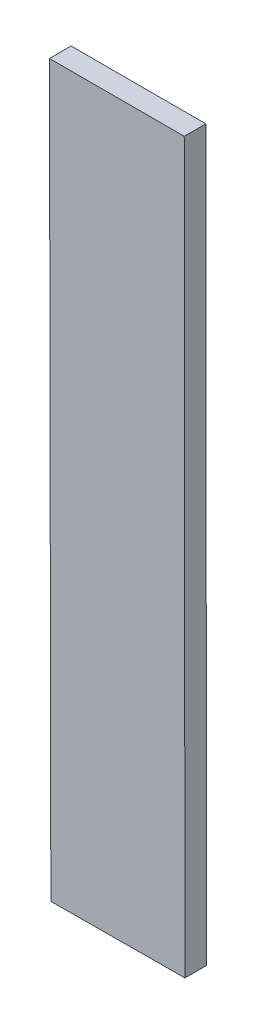
ISO-10303-21;
HEADER;
FILE_DESCRIPTION(('STEP AP214'),'2;1');
FILE_NAME('part.step','',(''),(''),'','','');
FILE_SCHEMA(('AUTOMOTIVE_DESIGN { 1 0 10303 214 1 1 1 1 }'));
ENDSEC;
DATA;
#1=APPLICATION_CONTEXT('core data for automotive mechanical design processes');
#2=APPLICATION_PROTOCOL_DEFINITION('international standard','automotive_design',2000,#1);
#3=PRODUCT_CONTEXT('',#1,'mechanical');
#4=PRODUCT('Part','Part','',(#3));
#5=PRODUCT_RELATED_PRODUCT_CATEGORY('part','',(#4));
#6=PRODUCT_DEFINITION_FORMATION('','',#4);
#7=PRODUCT_DEFINITION_CONTEXT('part definition',#1,'design');
#8=PRODUCT_DEFINITION('design','',#6,#7);
#9=PRODUCT_DEFINITION_SHAPE('','',#8);
#10=(LENGTH_UNIT() NAMED_UNIT(*) SI_UNIT(.MILLI.,.METRE.));
#11=(NAMED_UNIT(*) PLANE_ANGLE_UNIT() SI_UNIT($,.RADIAN.));
#12=(NAMED_UNIT(*) SI_UNIT($,.STERADIAN.) SOLID_ANGLE_UNIT());
#13=UNCERTAINTY_MEASURE_WITH_UNIT(LENGTH_MEASURE(1.E-05),#10,'distance_accuracy_value','');
#14=(GEOMETRIC_REPRESENTATION_CONTEXT(3) GLOBAL_UNCERTAINTY_ASSIGNED_CONTEXT((#13)) GLOBAL_UNIT_ASSIGNED_CONTEXT((#10,
#11,#12)) REPRESENTATION_CONTEXT('',''));
#15=CARTESIAN_POINT('',(0.,0.,0.));
#16=DIRECTION('',(0.,0.,1.));
#17=DIRECTION('',(1.,0.,0.));
#18=AXIS2_PLACEMENT_3D('',#15,#16,#17);
#19=CARTESIAN_POINT('',(0.,-48.5472175390625,0.001));
#20=DIRECTION('',(0.,-1.,0.));
#21=DIRECTION('',(0.,0.,-1.));
#22=AXIS2_PLACEMENT_3D('',#19,#20,#21);
#23=PLANE('',#22);
#24=DIRECTION('',(-1.,0.,0.));
#25=VECTOR('',#24,1.);
#26=CARTESIAN_POINT('',(0.,-48.5472175390625,0.));
#27=LINE('',#26,#25);
#28=CARTESIAN_POINT('',(-1.853980546875,-48.5472175390625,0.));
#29=VERTEX_POINT('',#28);
#30=CARTESIAN_POINT('',(-1.8602190234375,-48.5472175390625,0.));
#31=VERTEX_POINT('',#30);
#32=EDGE_CURVE('E11',#29,#31,#27,.T.);
#33=ORIENTED_EDGE('',*,*,#32,.T.);
#34=DIRECTION('',(0.,0.,-1.));
#35=VECTOR('',#34,1.);
#36=CARTESIAN_POINT('',(-1.8602190234375,-48.5472175390625,0.001));
#37=LINE('',#36,#35);
#38=CARTESIAN_POINT('',(-1.8602190234375,-48.5472175390625,0.001));
#39=VERTEX_POINT('',#38);
#40=EDGE_CURVE('E24',#39,#31,#37,.T.);
#41=ORIENTED_EDGE('',*,*,#40,.F.);
#42=DIRECTION('',(-1.,0.,0.));
#43=VECTOR('',#42,1.);
#44=CARTESIAN_POINT('',(0.,-48.5472175390625,0.001));
#45=LINE('',#44,#43);
#46=CARTESIAN_POINT('',(-1.853980546875,-48.5472175390625,0.001));
#47=VERTEX_POINT('',#46);
#48=EDGE_CURVE('E88',#47,#39,#45,.T.);
#49=ORIENTED_EDGE('',*,*,#48,.F.);
#50=DIRECTION('',(0.,0.,-1.));
#51=VECTOR('',#50,1.);
#52=CARTESIAN_POINT('',(-1.853980546875,-48.5472175390625,0.001));
#53=LINE('',#52,#51);
#54=EDGE_CURVE('E77',#47,#29,#53,.T.);
#55=ORIENTED_EDGE('',*,*,#54,.T.);
#56=EDGE_LOOP('',(#33,#41,#49,#55));
#57=FACE_BOUND('',#56,.T.);
#58=ADVANCED_FACE('F17',(#57),#23,.F.);
#59=CARTESIAN_POINT('',(-1.9522446473268,-0.00370093772007133,0.001));
#60=DIRECTION('',(0.999998203100012,0.0018957311907214,0.));
#61=DIRECTION('',(-0.0018957311907214,0.999998203100012,0.));
#62=AXIS2_PLACEMENT_3D('',#59,#60,#61);
#63=PLANE('',#62);
#64=DIRECTION('',(0.0018957311907214,-0.999998203100012,0.));
#65=VECTOR('',#64,1.);
#66=CARTESIAN_POINT('',(-1.9522446473268,-0.00370093772007133,0.));
#67=LINE('',#66,#65);
#68=CARTESIAN_POINT('',(-1.8601550390625,-48.580969296875,0.));
#69=VERTEX_POINT('',#68);
#70=EDGE_CURVE('E85',#31,#69,#67,.T.);
#71=ORIENTED_EDGE('',*,*,#70,.T.);
#72=DIRECTION('',(0.,0.,-1.));
#73=VECTOR('',#72,1.);
#74=CARTESIAN_POINT('',(-1.8601550390625,-48.580969296875,0.001));
#75=LINE('',#74,#73);
#76=CARTESIAN_POINT('',(-1.8601550390625,-48.580969296875,0.001));
#77=VERTEX_POINT('',#76);
#78=EDGE_CURVE('E83',#77,#69,#75,.T.);
#79=ORIENTED_EDGE('',*,*,#78,.F.);
#80=DIRECTION('',(0.0018957311907214,-0.999998203100012,0.));
#81=VECTOR('',#80,1.);
#82=CARTESIAN_POINT('',(-1.9522446473268,-0.00370093772007133,0.001));
#83=LINE('',#82,#81);
#84=EDGE_CURVE('E72',#39,#77,#83,.T.);
#85=ORIENTED_EDGE('',*,*,#84,.F.);
#86=ORIENTED_EDGE('',*,*,#40,.T.);
#87=EDGE_LOOP('',(#71,#79,#85,#86));
#88=FACE_BOUND('',#87,.T.);
#89=ADVANCED_FACE('F90',(#88),#63,.F.);
#90=CARTESIAN_POINT('',(0.250361290418771,-48.5700903467243,0.001));
#91=DIRECTION('',(-0.0051545706958729,0.999986715112227,0.));
#92=DIRECTION('',(-0.999986715112227,-0.0051545706958729,0.));
#93=AXIS2_PLACEMENT_3D('',#90,#91,#92);
#94=PLANE('',#93);
#95=DIRECTION('',(0.999986715112227,0.0051545706958729,0.));
#96=VECTOR('',#95,1.);
#97=CARTESIAN_POINT('',(0.250361290418771,-48.5700903467243,0.));
#98=LINE('',#97,#96);
#99=CARTESIAN_POINT('',(-1.8539485546875,-48.5809373046875,0.));
#100=VERTEX_POINT('',#99);
#101=EDGE_CURVE('E60',#69,#100,#98,.T.);
#102=ORIENTED_EDGE('',*,*,#101,.T.);
#103=DIRECTION('',(0.,0.,-1.));
#104=VECTOR('',#103,1.);
#105=CARTESIAN_POINT('',(-1.8539485546875,-48.5809373046875,0.001));
#106=LINE('',#105,#104);
#107=CARTESIAN_POINT('',(-1.8539485546875,-48.5809373046875,0.001));
#108=VERTEX_POINT('',#107);
#109=EDGE_CURVE('E54',#108,#100,#106,.T.);
#110=ORIENTED_EDGE('',*,*,#109,.F.);
#111=DIRECTION('',(0.999986715112227,0.0051545706958729,0.));
#112=VECTOR('',#111,1.);
#113=CARTESIAN_POINT('',(0.250361290418771,-48.5700903467243,0.001));
#114=LINE('',#113,#112);
#115=EDGE_CURVE('E58',#77,#108,#114,.T.);
#116=ORIENTED_EDGE('',*,*,#115,.F.);
#117=ORIENTED_EDGE('',*,*,#78,.T.);
#118=EDGE_LOOP('',(#102,#110,#116,#117));
#119=FACE_BOUND('',#118,.T.);
#120=ADVANCED_FACE('F56',(#119),#94,.F.);
#121=CARTESIAN_POINT('',(-1.9000388152293,-0.00180269337307432,0.001));
#122=DIRECTION('',(-0.99999954992127,-0.000948766176391401,0.));
#123=DIRECTION('',(0.000948766176391401,-0.99999954992127,0.));
#124=AXIS2_PLACEMENT_3D('',#121,#122,#123);
#125=PLANE('',#124);
#126=DIRECTION('',(-0.000948766176391401,0.99999954992127,0.));
#127=VECTOR('',#126,1.);
#128=CARTESIAN_POINT('',(-1.9000388152293,-0.00180269337307432,0.));
#129=LINE('',#128,#127);
#130=EDGE_CURVE('E73',#100,#29,#129,.T.);
#131=ORIENTED_EDGE('',*,*,#130,.T.);
#132=ORIENTED_EDGE('',*,*,#54,.F.);
#133=DIRECTION('',(-0.000948766176391401,0.99999954992127,0.));
#134=VECTOR('',#133,1.);
#135=CARTESIAN_POINT('',(-1.9000388152293,-0.00180269337307432,0.001));
#136=LINE('',#135,#134);
#137=EDGE_CURVE('E70',#108,#47,#136,.T.);
#138=ORIENTED_EDGE('',*,*,#137,.F.);
#139=ORIENTED_EDGE('',*,*,#109,.T.);
#140=EDGE_LOOP('',(#131,#132,#138,#139));
#141=FACE_BOUND('',#140,.T.);
#142=ADVANCED_FACE('F76',(#141),#125,.F.);
#143=CARTESIAN_POINT('',(0.,0.,0.001));
#144=DIRECTION('',(0.,0.,1.));
#145=DIRECTION('',(1.,0.,0.));
#146=AXIS2_PLACEMENT_3D('',#143,#144,#145);
#147=PLANE('',#146);
#148=ORIENTED_EDGE('',*,*,#48,.T.);
#149=ORIENTED_EDGE('',*,*,#84,.T.);
#150=ORIENTED_EDGE('',*,*,#115,.T.);
#151=ORIENTED_EDGE('',*,*,#137,.T.);
#152=EDGE_LOOP('',(#148,#149,#150,#151));
#153=FACE_BOUND('',#152,.T.);
#154=ADVANCED_FACE('F69',(#153),#147,.T.);
#155=CARTESIAN_POINT('',(0.,0.,0.));
#156=DIRECTION('',(0.,0.,1.));
#157=DIRECTION('',(1.,0.,0.));
#158=AXIS2_PLACEMENT_3D('',#155,#156,#157);
#159=PLANE('',#158);
#160=ORIENTED_EDGE('',*,*,#32,.F.);
#161=ORIENTED_EDGE('',*,*,#130,.F.);
#162=ORIENTED_EDGE('',*,*,#101,.F.);
#163=ORIENTED_EDGE('',*,*,#70,.F.);
#164=EDGE_LOOP('',(#160,#161,#162,#163));
#165=FACE_BOUND('',#164,.T.);
#166=ADVANCED_FACE('F91',(#165),#159,.F.);
#167=CLOSED_SHELL('',(#58,#89,#120,#142,#154,#166));
#168=MANIFOLD_SOLID_BREP('B1',#167);
#169=ADVANCED_BREP_SHAPE_REPRESENTATION('',(#18,#168),#14);
#170=SHAPE_DEFINITION_REPRESENTATION(#9,#169);
ENDSEC;
END-ISO-10303-21;
